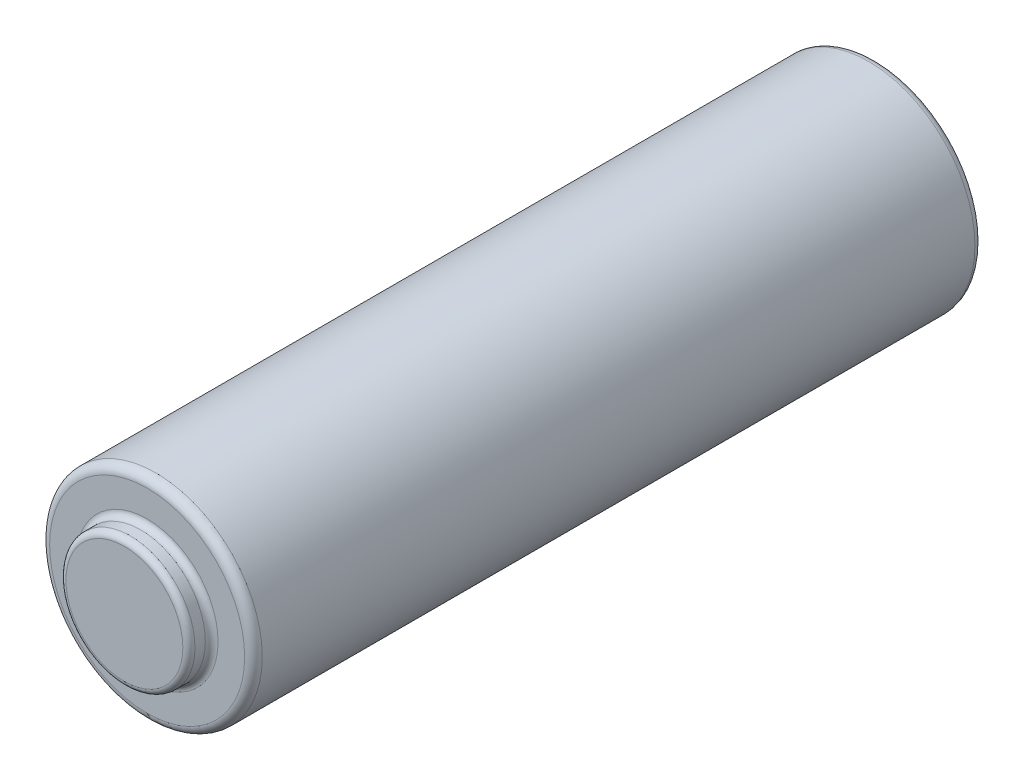
ISO-10303-21;
HEADER;
FILE_DESCRIPTION(('STEP AP214'),'2;1');
FILE_NAME('part.step','',(''),(''),'','','');
FILE_SCHEMA(('AUTOMOTIVE_DESIGN { 1 0 10303 214 1 1 1 1 }'));
ENDSEC;
DATA;
#1=APPLICATION_CONTEXT('core data for automotive mechanical design processes');
#2=APPLICATION_PROTOCOL_DEFINITION('international standard','automotive_design',2000,#1);
#3=PRODUCT_CONTEXT('',#1,'mechanical');
#4=PRODUCT('Part','Part','',(#3));
#5=PRODUCT_RELATED_PRODUCT_CATEGORY('part','',(#4));
#6=PRODUCT_DEFINITION_FORMATION('','',#4);
#7=PRODUCT_DEFINITION_CONTEXT('part definition',#1,'design');
#8=PRODUCT_DEFINITION('design','',#6,#7);
#9=PRODUCT_DEFINITION_SHAPE('','',#8);
#10=(LENGTH_UNIT() NAMED_UNIT(*) SI_UNIT(.MILLI.,.METRE.));
#11=(NAMED_UNIT(*) PLANE_ANGLE_UNIT() SI_UNIT($,.RADIAN.));
#12=(NAMED_UNIT(*) SI_UNIT($,.STERADIAN.) SOLID_ANGLE_UNIT());
#13=UNCERTAINTY_MEASURE_WITH_UNIT(LENGTH_MEASURE(1.E-05),#10,'distance_accuracy_value','');
#14=(GEOMETRIC_REPRESENTATION_CONTEXT(3) GLOBAL_UNCERTAINTY_ASSIGNED_CONTEXT((#13)) GLOBAL_UNIT_ASSIGNED_CONTEXT((#10,
#11,#12)) REPRESENTATION_CONTEXT('',''));
#15=CARTESIAN_POINT('',(0.,0.,0.));
#16=DIRECTION('',(0.,0.,1.));
#17=DIRECTION('',(1.,0.,0.));
#18=AXIS2_PLACEMENT_3D('',#15,#16,#17);
#19=CARTESIAN_POINT('',(0.,0.,49.5));
#20=DIRECTION('',(0.,0.,1.));
#21=DIRECTION('',(1.,0.,0.));
#22=AXIS2_PLACEMENT_3D('',#19,#20,#21);
#23=PLANE('',#22);
#24=CARTESIAN_POINT('',(0.,0.,49.5));
#25=DIRECTION('',(0.,0.,-1.));
#26=DIRECTION('',(1.,0.,0.));
#27=AXIS2_PLACEMENT_3D('',#24,#25,#26);
#28=CIRCLE('',#27,3.85);
#29=CARTESIAN_POINT('',(3.85,0.,49.5));
#30=VERTEX_POINT('',#29);
#31=CARTESIAN_POINT('',(-3.85,0.,49.5));
#32=VERTEX_POINT('',#31);
#33=EDGE_CURVE('E59',#30,#32,#28,.T.);
#34=ORIENTED_EDGE('',*,*,#33,.F.);
#35=CARTESIAN_POINT('',(0.,0.,49.5));
#36=DIRECTION('',(0.,0.,-1.));
#37=DIRECTION('',(-1.,0.,0.));
#38=AXIS2_PLACEMENT_3D('',#35,#36,#37);
#39=CIRCLE('',#38,3.85);
#40=EDGE_CURVE('E55',#32,#30,#39,.T.);
#41=ORIENTED_EDGE('',*,*,#40,.F.);
#42=EDGE_LOOP('',(#34,#41));
#43=FACE_BOUND('',#42,.T.);
#44=ADVANCED_FACE('F17',(#43),#23,.T.);
#45=CARTESIAN_POINT('',(0.,0.,49.1));
#46=DIRECTION('',(0.,0.,1.));
#47=DIRECTION('',(1.,0.,0.));
#48=AXIS2_PLACEMENT_3D('',#45,#46,#47);
#49=TOROIDAL_SURFACE('',#48,3.85,0.4);
#50=ORIENTED_EDGE('',*,*,#40,.T.);
#51=ORIENTED_EDGE('',*,*,#33,.T.);
#52=EDGE_LOOP('',(#50,#51));
#53=FACE_BOUND('',#52,.T.);
#54=CARTESIAN_POINT('',(0.,0.,49.1));
#55=DIRECTION('',(0.,0.,1.));
#56=DIRECTION('',(1.,0.,0.));
#57=AXIS2_PLACEMENT_3D('',#54,#55,#56);
#58=CIRCLE('',#57,4.25);
#59=CARTESIAN_POINT('',(4.25,0.,49.1));
#60=VERTEX_POINT('',#59);
#61=EDGE_CURVE('E66',#60,#60,#58,.F.);
#62=ORIENTED_EDGE('',*,*,#61,.F.);
#63=EDGE_LOOP('',(#62));
#64=FACE_BOUND('',#63,.T.);
#65=ADVANCED_FACE('F64',(#53,#64),#49,.T.);
#66=CARTESIAN_POINT('',(0.,0.,48.));
#67=DIRECTION('',(0.,0.,1.));
#68=DIRECTION('',(1.,0.,0.));
#69=AXIS2_PLACEMENT_3D('',#66,#67,#68);
#70=CYLINDRICAL_SURFACE('',#69,4.25);
#71=ORIENTED_EDGE('',*,*,#61,.T.);
#72=EDGE_LOOP('',(#71));
#73=FACE_BOUND('',#72,.T.);
#74=CARTESIAN_POINT('',(0.,0.,48.42));
#75=DIRECTION('',(0.,0.,1.));
#76=DIRECTION('',(1.,0.,0.));
#77=AXIS2_PLACEMENT_3D('',#74,#75,#76);
#78=CIRCLE('',#77,4.25);
#79=CARTESIAN_POINT('',(4.25,0.,48.42));
#80=VERTEX_POINT('',#79);
#81=EDGE_CURVE('E98',#80,#80,#78,.T.);
#82=ORIENTED_EDGE('',*,*,#81,.T.);
#83=EDGE_LOOP('',(#82));
#84=FACE_BOUND('',#83,.T.);
#85=ADVANCED_FACE('F84',(#73,#84),#70,.T.);
#86=CARTESIAN_POINT('',(0.,0.,48.42));
#87=DIRECTION('',(0.,0.,1.));
#88=DIRECTION('',(1.,0.,0.));
#89=AXIS2_PLACEMENT_3D('',#86,#87,#88);
#90=TOROIDAL_SURFACE('',#89,4.67,0.42);
#91=CARTESIAN_POINT('',(0.,0.,48.));
#92=DIRECTION('',(0.,0.,1.));
#93=DIRECTION('',(-1.,0.,0.));
#94=AXIS2_PLACEMENT_3D('',#91,#92,#93);
#95=CIRCLE('',#94,4.67);
#96=CARTESIAN_POINT('',(4.67,0.,48.));
#97=VERTEX_POINT('',#96);
#98=CARTESIAN_POINT('',(-4.67,0.,48.));
#99=VERTEX_POINT('',#98);
#100=EDGE_CURVE('E166',#97,#99,#95,.F.);
#101=ORIENTED_EDGE('',*,*,#100,.F.);
#102=CARTESIAN_POINT('',(0.,0.,48.));
#103=DIRECTION('',(0.,0.,1.));
#104=DIRECTION('',(1.,0.,0.));
#105=AXIS2_PLACEMENT_3D('',#102,#103,#104);
#106=CIRCLE('',#105,4.67);
#107=EDGE_CURVE('E156',#99,#97,#106,.F.);
#108=ORIENTED_EDGE('',*,*,#107,.F.);
#109=EDGE_LOOP('',(#101,#108));
#110=FACE_BOUND('',#109,.T.);
#111=ORIENTED_EDGE('',*,*,#81,.F.);
#112=EDGE_LOOP('',(#111));
#113=FACE_BOUND('',#112,.T.);
#114=ADVANCED_FACE('F106',(#110,#113),#90,.F.);
#115=CARTESIAN_POINT('',(0.,0.,0.));
#116=DIRECTION('',(0.,0.,1.));
#117=DIRECTION('',(1.,0.,0.));
#118=AXIS2_PLACEMENT_3D('',#115,#116,#117);
#119=PLANE('',#118);
#120=CARTESIAN_POINT('',(0.,0.,0.));
#121=DIRECTION('',(0.,0.,1.));
#122=DIRECTION('',(1.,0.,0.));
#123=AXIS2_PLACEMENT_3D('',#120,#121,#122);
#124=CIRCLE('',#123,6.51);
#125=CARTESIAN_POINT('',(6.51,0.,0.));
#126=VERTEX_POINT('',#125);
#127=CARTESIAN_POINT('',(-6.51,0.,0.));
#128=VERTEX_POINT('',#127);
#129=EDGE_CURVE('E206',#126,#128,#124,.T.);
#130=ORIENTED_EDGE('',*,*,#129,.F.);
#131=CARTESIAN_POINT('',(0.,0.,0.));
#132=DIRECTION('',(0.,0.,1.));
#133=DIRECTION('',(-1.,0.,0.));
#134=AXIS2_PLACEMENT_3D('',#131,#132,#133);
#135=CIRCLE('',#134,6.51);
#136=EDGE_CURVE('E100',#128,#126,#135,.T.);
#137=ORIENTED_EDGE('',*,*,#136,.F.);
#138=EDGE_LOOP('',(#130,#137));
#139=FACE_BOUND('',#138,.T.);
#140=ADVANCED_FACE('F115',(#139),#119,.F.);
#141=CARTESIAN_POINT('',(0.,0.,48.));
#142=DIRECTION('',(0.,0.,1.));
#143=DIRECTION('',(1.,0.,0.));
#144=AXIS2_PLACEMENT_3D('',#141,#142,#143);
#145=PLANE('',#144);
#146=CARTESIAN_POINT('',(0.,0.,48.));
#147=DIRECTION('',(0.,0.,-1.));
#148=DIRECTION('',(-1.,0.,0.));
#149=AXIS2_PLACEMENT_3D('',#146,#147,#148);
#150=CIRCLE('',#149,6.42);
#151=CARTESIAN_POINT('',(-6.42,0.,48.));
#152=VERTEX_POINT('',#151);
#153=CARTESIAN_POINT('',(6.42,0.,48.));
#154=VERTEX_POINT('',#153);
#155=EDGE_CURVE('E124',#152,#154,#150,.T.);
#156=ORIENTED_EDGE('',*,*,#155,.F.);
#157=CARTESIAN_POINT('',(0.,0.,48.));
#158=DIRECTION('',(0.,0.,-1.));
#159=DIRECTION('',(1.,0.,0.));
#160=AXIS2_PLACEMENT_3D('',#157,#158,#159);
#161=CIRCLE('',#160,6.42);
#162=EDGE_CURVE('E36',#152,#154,#161,.F.);
#163=ORIENTED_EDGE('',*,*,#162,.T.);
#164=EDGE_LOOP('',(#156,#163));
#165=FACE_BOUND('',#164,.T.);
#166=ORIENTED_EDGE('',*,*,#107,.T.);
#167=ORIENTED_EDGE('',*,*,#100,.T.);
#168=EDGE_LOOP('',(#166,#167));
#169=FACE_BOUND('',#168,.T.);
#170=ADVANCED_FACE('F142',(#165,#169),#145,.T.);
#171=CARTESIAN_POINT('',(0.,0.,0.49));
#172=DIRECTION('',(0.,0.,1.));
#173=DIRECTION('',(1.,0.,0.));
#174=AXIS2_PLACEMENT_3D('',#171,#172,#173);
#175=TOROIDAL_SURFACE('',#174,6.51,0.49);
#176=ORIENTED_EDGE('',*,*,#136,.T.);
#177=ORIENTED_EDGE('',*,*,#129,.T.);
#178=EDGE_LOOP('',(#176,#177));
#179=FACE_BOUND('',#178,.T.);
#180=CARTESIAN_POINT('',(0.,0.,0.49));
#181=DIRECTION('',(0.,0.,1.));
#182=DIRECTION('',(1.,0.,0.));
#183=AXIS2_PLACEMENT_3D('',#180,#181,#182);
#184=CIRCLE('',#183,7.);
#185=CARTESIAN_POINT('',(7.,0.,0.49));
#186=VERTEX_POINT('',#185);
#187=EDGE_CURVE('E28',#186,#186,#184,.T.);
#188=ORIENTED_EDGE('',*,*,#187,.F.);
#189=EDGE_LOOP('',(#188));
#190=FACE_BOUND('',#189,.T.);
#191=ADVANCED_FACE('F131',(#179,#190),#175,.T.);
#192=CARTESIAN_POINT('',(0.,0.,47.42));
#193=DIRECTION('',(0.,0.,-1.));
#194=DIRECTION('',(-1.,0.,0.));
#195=AXIS2_PLACEMENT_3D('',#192,#193,#194);
#196=TOROIDAL_SURFACE('',#195,6.42,0.58);
#197=CARTESIAN_POINT('',(0.,0.,47.42));
#198=DIRECTION('',(0.,0.,1.));
#199=DIRECTION('',(1.,0.,0.));
#200=AXIS2_PLACEMENT_3D('',#197,#198,#199);
#201=CIRCLE('',#200,7.);
#202=CARTESIAN_POINT('',(7.,0.,47.42));
#203=VERTEX_POINT('',#202);
#204=EDGE_CURVE('E11',#203,#203,#201,.F.);
#205=ORIENTED_EDGE('',*,*,#204,.F.);
#206=EDGE_LOOP('',(#205));
#207=FACE_BOUND('',#206,.T.);
#208=ORIENTED_EDGE('',*,*,#155,.T.);
#209=ORIENTED_EDGE('',*,*,#162,.F.);
#210=EDGE_LOOP('',(#208,#209));
#211=FACE_BOUND('',#210,.T.);
#212=ADVANCED_FACE('F141',(#207,#211),#196,.T.);
#213=CARTESIAN_POINT('',(0.,0.,0.));
#214=DIRECTION('',(0.,0.,1.));
#215=DIRECTION('',(1.,0.,0.));
#216=AXIS2_PLACEMENT_3D('',#213,#214,#215);
#217=CYLINDRICAL_SURFACE('',#216,7.);
#218=ORIENTED_EDGE('',*,*,#187,.T.);
#219=EDGE_LOOP('',(#218));
#220=FACE_BOUND('',#219,.T.);
#221=ORIENTED_EDGE('',*,*,#204,.T.);
#222=EDGE_LOOP('',(#221));
#223=FACE_BOUND('',#222,.T.);
#224=ADVANCED_FACE('F225',(#220,#223),#217,.T.);
#225=CLOSED_SHELL('',(#44,#65,#85,#114,#140,#170,#191,#212,#224));
#226=MANIFOLD_SOLID_BREP('B1',#225);
#227=ADVANCED_BREP_SHAPE_REPRESENTATION('',(#18,#226),#14);
#228=SHAPE_DEFINITION_REPRESENTATION(#9,#227);
ENDSEC;
END-ISO-10303-21;
